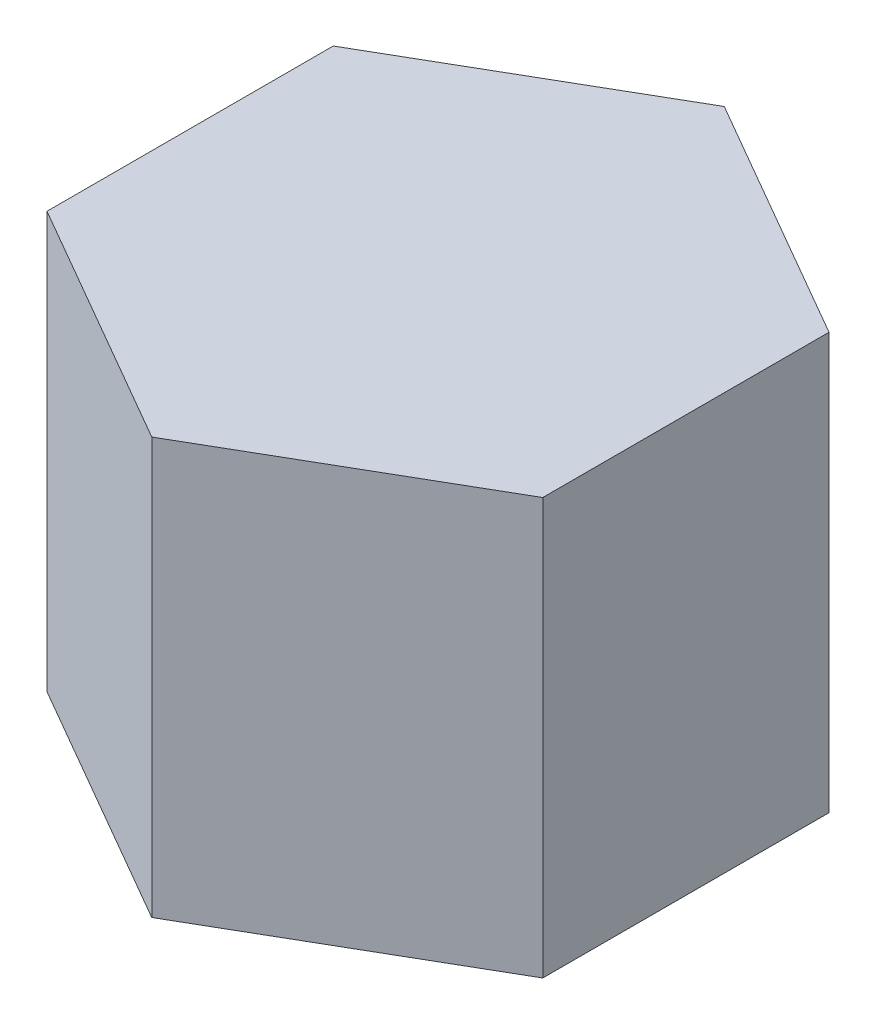
ISO-10303-21;
HEADER;
FILE_DESCRIPTION(('STEP AP214'),'2;1');
FILE_NAME('part.step','',(''),(''),'','','');
FILE_SCHEMA(('AUTOMOTIVE_DESIGN { 1 0 10303 214 1 1 1 1 }'));
ENDSEC;
DATA;
#1=APPLICATION_CONTEXT('core data for automotive mechanical design processes');
#2=APPLICATION_PROTOCOL_DEFINITION('international standard','automotive_design',2000,#1);
#3=PRODUCT_CONTEXT('',#1,'mechanical');
#4=PRODUCT('Part','Part','',(#3));
#5=PRODUCT_RELATED_PRODUCT_CATEGORY('part','',(#4));
#6=PRODUCT_DEFINITION_FORMATION('','',#4);
#7=PRODUCT_DEFINITION_CONTEXT('part definition',#1,'design');
#8=PRODUCT_DEFINITION('design','',#6,#7);
#9=PRODUCT_DEFINITION_SHAPE('','',#8);
#10=(LENGTH_UNIT() NAMED_UNIT(*) SI_UNIT(.MILLI.,.METRE.));
#11=(NAMED_UNIT(*) PLANE_ANGLE_UNIT() SI_UNIT($,.RADIAN.));
#12=(NAMED_UNIT(*) SI_UNIT($,.STERADIAN.) SOLID_ANGLE_UNIT());
#13=UNCERTAINTY_MEASURE_WITH_UNIT(LENGTH_MEASURE(1.E-05),#10,'distance_accuracy_value','');
#14=(GEOMETRIC_REPRESENTATION_CONTEXT(3) GLOBAL_UNCERTAINTY_ASSIGNED_CONTEXT((#13)) GLOBAL_UNIT_ASSIGNED_CONTEXT((#10,
#11,#12)) REPRESENTATION_CONTEXT('',''));
#15=CARTESIAN_POINT('',(0.,0.,0.));
#16=DIRECTION('',(0.,0.,1.));
#17=DIRECTION('',(1.,0.,0.));
#18=AXIS2_PLACEMENT_3D('',#15,#16,#17);
#19=CARTESIAN_POINT('',(207.839551417381,-147.556598747966,294.280047431848));
#20=DIRECTION('',(-0.500000000000062,0.,-0.866025403784403));
#21=DIRECTION('',(-0.866025403784403,0.,0.500000000000062));
#22=AXIS2_PLACEMENT_3D('',#19,#20,#21);
#23=PLANE('',#22);
#24=CARTESIAN_POINT('',(208.142660308706,-147.047793579175,294.105047431848));
#25=DIRECTION('',(-0.866025403784403,0.,0.500000000000062));
#26=VECTOR('',#25,1.);
#27=LINE('',#24,#26);
#28=CARTESIAN_POINT('',(208.142660308706,-147.047793579175,294.105047431848));
#29=VERTEX_POINT('',#28);
#30=CARTESIAN_POINT('',(207.839551417382,-147.047793579175,294.280047431848));
#31=VERTEX_POINT('',#30);
#32=EDGE_CURVE('E170',#29,#31,#27,.T.);
#33=ORIENTED_EDGE('',*,*,#32,.T.);
#34=CARTESIAN_POINT('',(207.839551417382,-147.556598747966,294.280047431848));
#35=DIRECTION('',(0.,1.,0.));
#36=VECTOR('',#35,1.);
#37=LINE('',#34,#36);
#38=CARTESIAN_POINT('',(207.839551417382,-147.556598747966,294.280047431848));
#39=VERTEX_POINT('',#38);
#40=EDGE_CURVE('E35',#39,#31,#37,.T.);
#41=ORIENTED_EDGE('',*,*,#40,.F.);
#42=CARTESIAN_POINT('',(208.142660308706,-147.556598747966,294.105047431848));
#43=DIRECTION('',(-0.866025403784403,0.,0.500000000000062));
#44=VECTOR('',#43,1.);
#45=LINE('',#42,#44);
#46=CARTESIAN_POINT('',(208.142660308706,-147.556598747966,294.105047431848));
#47=VERTEX_POINT('',#46);
#48=EDGE_CURVE('E159',#47,#39,#45,.T.);
#49=ORIENTED_EDGE('',*,*,#48,.F.);
#50=CARTESIAN_POINT('',(208.142660308706,-147.556598747966,294.105047431848));
#51=DIRECTION('',(0.,1.,0.));
#52=VECTOR('',#51,1.);
#53=LINE('',#50,#52);
#54=EDGE_CURVE('E10',#47,#29,#53,.T.);
#55=ORIENTED_EDGE('',*,*,#54,.T.);
#56=EDGE_LOOP('',(#33,#41,#49,#55));
#57=FACE_BOUND('',#56,.T.);
#58=ADVANCED_FACE('F16',(#57),#23,.F.);
#59=CARTESIAN_POINT('',(208.142660308706,-147.556598747966,291.594471220494));
#60=DIRECTION('',(-1.,0.,0.));
#61=DIRECTION('',(0.,-1.,0.));
#62=AXIS2_PLACEMENT_3D('',#59,#60,#61);
#63=PLANE('',#62);
#64=CARTESIAN_POINT('',(208.142660308706,-147.047793579175,293.755047431848));
#65=DIRECTION('',(0.,0.,1.));
#66=VECTOR('',#65,1.);
#67=LINE('',#64,#66);
#68=CARTESIAN_POINT('',(208.142660308706,-147.047793579175,293.755047431848));
#69=VERTEX_POINT('',#68);
#70=EDGE_CURVE('E167',#69,#29,#67,.T.);
#71=ORIENTED_EDGE('',*,*,#70,.T.);
#72=ORIENTED_EDGE('',*,*,#54,.F.);
#73=CARTESIAN_POINT('',(208.142660308706,-147.556598747966,293.755047431848));
#74=DIRECTION('',(0.,0.,1.));
#75=VECTOR('',#74,1.);
#76=LINE('',#73,#75);
#77=CARTESIAN_POINT('',(208.142660308706,-147.556598747966,293.755047431848));
#78=VERTEX_POINT('',#77);
#79=EDGE_CURVE('E156',#78,#47,#76,.T.);
#80=ORIENTED_EDGE('',*,*,#79,.F.);
#81=CARTESIAN_POINT('',(208.142660308706,-147.556598747966,293.755047431848));
#82=DIRECTION('',(0.,1.,0.));
#83=VECTOR('',#82,1.);
#84=LINE('',#81,#83);
#85=EDGE_CURVE('E27',#78,#69,#84,.T.);
#86=ORIENTED_EDGE('',*,*,#85,.T.);
#87=EDGE_LOOP('',(#71,#72,#80,#86));
#88=FACE_BOUND('',#87,.T.);
#89=ADVANCED_FACE('F189',(#88),#63,.F.);
#90=CARTESIAN_POINT('',(208.142660308706,-147.556598747966,293.755047431848));
#91=DIRECTION('',(-0.500000000000096,0.,0.866025403784383));
#92=DIRECTION('',(0.866025403784383,0.,0.500000000000096));
#93=AXIS2_PLACEMENT_3D('',#90,#91,#92);
#94=PLANE('',#93);
#95=CARTESIAN_POINT('',(207.839551417382,-147.047793579175,293.580047431848));
#96=DIRECTION('',(0.866025403784383,0.,0.500000000000096));
#97=VECTOR('',#96,1.);
#98=LINE('',#95,#97);
#99=CARTESIAN_POINT('',(207.839551417382,-147.047793579175,293.580047431848));
#100=VERTEX_POINT('',#99);
#101=EDGE_CURVE('E163',#100,#69,#98,.T.);
#102=ORIENTED_EDGE('',*,*,#101,.T.);
#103=ORIENTED_EDGE('',*,*,#85,.F.);
#104=CARTESIAN_POINT('',(207.839551417382,-147.556598747966,293.580047431848));
#105=DIRECTION('',(0.866025403784383,0.,0.500000000000096));
#106=VECTOR('',#105,1.);
#107=LINE('',#104,#106);
#108=CARTESIAN_POINT('',(207.839551417382,-147.556598747966,293.580047431848));
#109=VERTEX_POINT('',#108);
#110=EDGE_CURVE('E106',#109,#78,#107,.T.);
#111=ORIENTED_EDGE('',*,*,#110,.F.);
#112=CARTESIAN_POINT('',(207.839551417382,-147.556598747966,293.580047431848));
#113=DIRECTION('',(0.,1.,0.));
#114=VECTOR('',#113,1.);
#115=LINE('',#112,#114);
#116=EDGE_CURVE('E94',#109,#100,#115,.T.);
#117=ORIENTED_EDGE('',*,*,#116,.T.);
#118=EDGE_LOOP('',(#102,#103,#111,#117));
#119=FACE_BOUND('',#118,.T.);
#120=ADVANCED_FACE('F198',(#119),#94,.F.);
#121=CARTESIAN_POINT('',(207.839551417382,-147.556598747966,293.580047431848));
#122=DIRECTION('',(0.499999999999978,0.,0.866025403784452));
#123=DIRECTION('',(0.866025403784452,0.,-0.499999999999978));
#124=AXIS2_PLACEMENT_3D('',#121,#122,#123);
#125=PLANE('',#124);
#126=CARTESIAN_POINT('',(207.536442526057,-147.047793579175,293.755047431848));
#127=DIRECTION('',(0.866025403784452,0.,-0.499999999999978));
#128=VECTOR('',#127,1.);
#129=LINE('',#126,#128);
#130=CARTESIAN_POINT('',(207.536442526057,-147.047793579175,293.755047431848));
#131=VERTEX_POINT('',#130);
#132=EDGE_CURVE('E162',#131,#100,#129,.T.);
#133=ORIENTED_EDGE('',*,*,#132,.T.);
#134=ORIENTED_EDGE('',*,*,#116,.F.);
#135=CARTESIAN_POINT('',(207.536442526057,-147.556598747966,293.755047431848));
#136=DIRECTION('',(0.866025403784452,0.,-0.499999999999978));
#137=VECTOR('',#136,1.);
#138=LINE('',#135,#137);
#139=CARTESIAN_POINT('',(207.536442526057,-147.556598747966,293.755047431848));
#140=VERTEX_POINT('',#139);
#141=EDGE_CURVE('E98',#140,#109,#138,.T.);
#142=ORIENTED_EDGE('',*,*,#141,.F.);
#143=CARTESIAN_POINT('',(207.536442526057,-147.556598747966,293.755047431848));
#144=DIRECTION('',(0.,1.,0.));
#145=VECTOR('',#144,1.);
#146=LINE('',#143,#145);
#147=EDGE_CURVE('E79',#140,#131,#146,.T.);
#148=ORIENTED_EDGE('',*,*,#147,.T.);
#149=EDGE_LOOP('',(#133,#134,#142,#148));
#150=FACE_BOUND('',#149,.T.);
#151=ADVANCED_FACE('F100',(#150),#125,.F.);
#152=CARTESIAN_POINT('',(207.536442526057,-147.556598747966,291.594471220494));
#153=DIRECTION('',(1.,0.,0.));
#154=DIRECTION('',(0.,1.,0.));
#155=AXIS2_PLACEMENT_3D('',#152,#153,#154);
#156=PLANE('',#155);
#157=CARTESIAN_POINT('',(207.536442526057,-147.047793579175,294.105047431848));
#158=DIRECTION('',(0.,0.,-1.));
#159=VECTOR('',#158,1.);
#160=LINE('',#157,#159);
#161=CARTESIAN_POINT('',(207.536442526057,-147.047793579175,294.105047431848));
#162=VERTEX_POINT('',#161);
#163=EDGE_CURVE('E88',#162,#131,#160,.T.);
#164=ORIENTED_EDGE('',*,*,#163,.T.);
#165=ORIENTED_EDGE('',*,*,#147,.F.);
#166=CARTESIAN_POINT('',(207.536442526057,-147.556598747966,294.105047431848));
#167=DIRECTION('',(0.,0.,-1.));
#168=VECTOR('',#167,1.);
#169=LINE('',#166,#168);
#170=CARTESIAN_POINT('',(207.536442526057,-147.556598747966,294.105047431848));
#171=VERTEX_POINT('',#170);
#172=EDGE_CURVE('E84',#171,#140,#169,.T.);
#173=ORIENTED_EDGE('',*,*,#172,.F.);
#174=CARTESIAN_POINT('',(207.536442526057,-147.556598747966,294.105047431848));
#175=DIRECTION('',(0.,1.,0.));
#176=VECTOR('',#175,1.);
#177=LINE('',#174,#176);
#178=EDGE_CURVE('E58',#171,#162,#177,.T.);
#179=ORIENTED_EDGE('',*,*,#178,.T.);
#180=EDGE_LOOP('',(#164,#165,#173,#179));
#181=FACE_BOUND('',#180,.T.);
#182=ADVANCED_FACE('F82',(#181),#156,.F.);
#183=CARTESIAN_POINT('',(207.536442526057,-147.556598747966,294.105047431848));
#184=DIRECTION('',(0.500000000000062,0.,-0.866025403784403));
#185=DIRECTION('',(-0.866025403784403,0.,-0.500000000000062));
#186=AXIS2_PLACEMENT_3D('',#183,#184,#185);
#187=PLANE('',#186);
#188=CARTESIAN_POINT('',(207.839551417382,-147.047793579175,294.280047431848));
#189=DIRECTION('',(-0.866025403784403,0.,-0.500000000000062));
#190=VECTOR('',#189,1.);
#191=LINE('',#188,#190);
#192=EDGE_CURVE('E160',#31,#162,#191,.T.);
#193=ORIENTED_EDGE('',*,*,#192,.T.);
#194=ORIENTED_EDGE('',*,*,#178,.F.);
#195=CARTESIAN_POINT('',(207.839551417382,-147.556598747966,294.280047431848));
#196=DIRECTION('',(-0.866025403784403,0.,-0.500000000000062));
#197=VECTOR('',#196,1.);
#198=LINE('',#195,#197);
#199=EDGE_CURVE('E112',#39,#171,#198,.T.);
#200=ORIENTED_EDGE('',*,*,#199,.F.);
#201=ORIENTED_EDGE('',*,*,#40,.T.);
#202=EDGE_LOOP('',(#193,#194,#200,#201));
#203=FACE_BOUND('',#202,.T.);
#204=ADVANCED_FACE('F131',(#203),#187,.F.);
#205=CARTESIAN_POINT('',(206.491105863044,-147.556598747966,291.594471220494));
#206=DIRECTION('',(0.,1.,0.));
#207=DIRECTION('',(-1.,0.,0.));
#208=AXIS2_PLACEMENT_3D('',#205,#206,#207);
#209=PLANE('',#208);
#210=ORIENTED_EDGE('',*,*,#48,.T.);
#211=ORIENTED_EDGE('',*,*,#199,.T.);
#212=ORIENTED_EDGE('',*,*,#172,.T.);
#213=ORIENTED_EDGE('',*,*,#141,.T.);
#214=ORIENTED_EDGE('',*,*,#110,.T.);
#215=ORIENTED_EDGE('',*,*,#79,.T.);
#216=EDGE_LOOP('',(#210,#211,#212,#213,#214,#215));
#217=FACE_BOUND('',#216,.T.);
#218=ADVANCED_FACE('F111',(#217),#209,.F.);
#219=CARTESIAN_POINT('',(206.491105863044,-147.047793579175,291.594471220494));
#220=DIRECTION('',(0.,1.,0.));
#221=DIRECTION('',(-1.,0.,0.));
#222=AXIS2_PLACEMENT_3D('',#219,#220,#221);
#223=PLANE('',#222);
#224=ORIENTED_EDGE('',*,*,#32,.F.);
#225=ORIENTED_EDGE('',*,*,#70,.F.);
#226=ORIENTED_EDGE('',*,*,#101,.F.);
#227=ORIENTED_EDGE('',*,*,#132,.F.);
#228=ORIENTED_EDGE('',*,*,#163,.F.);
#229=ORIENTED_EDGE('',*,*,#192,.F.);
#230=EDGE_LOOP('',(#224,#225,#226,#227,#228,#229));
#231=FACE_BOUND('',#230,.T.);
#232=ADVANCED_FACE('F130',(#231),#223,.T.);
#233=CLOSED_SHELL('',(#58,#89,#120,#151,#182,#204,#218,#232));
#234=MANIFOLD_SOLID_BREP('B1',#233);
#235=ADVANCED_BREP_SHAPE_REPRESENTATION('',(#18,#234),#14);
#236=SHAPE_DEFINITION_REPRESENTATION(#9,#235);
ENDSEC;
END-ISO-10303-21;
